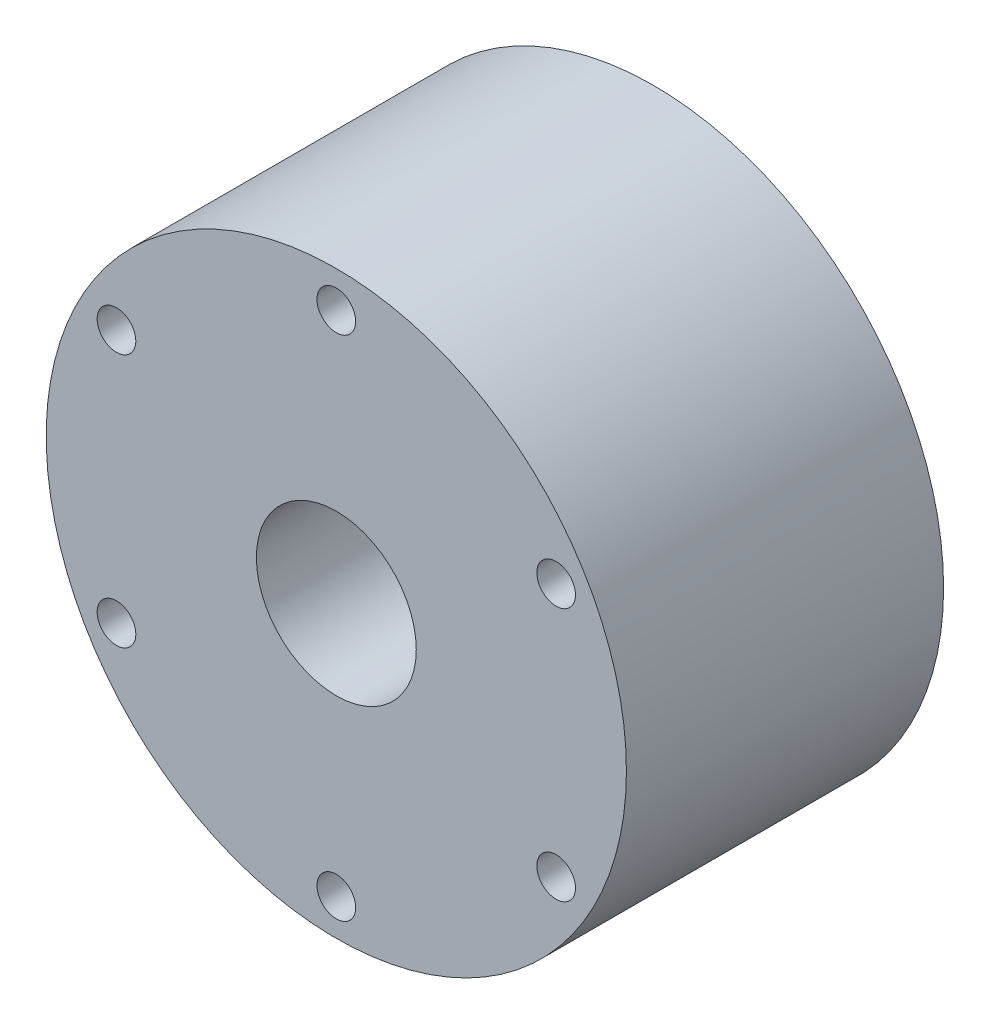
ISO-10303-21;
HEADER;
FILE_DESCRIPTION(('STEP AP214'),'2;1');
FILE_NAME('part.step','',(''),(''),'','','');
FILE_SCHEMA(('AUTOMOTIVE_DESIGN { 1 0 10303 214 1 1 1 1 }'));
ENDSEC;
DATA;
#1=APPLICATION_CONTEXT('core data for automotive mechanical design processes');
#2=APPLICATION_PROTOCOL_DEFINITION('international standard','automotive_design',2000,#1);
#3=PRODUCT_CONTEXT('',#1,'mechanical');
#4=PRODUCT('Part','Part','',(#3));
#5=PRODUCT_RELATED_PRODUCT_CATEGORY('part','',(#4));
#6=PRODUCT_DEFINITION_FORMATION('','',#4);
#7=PRODUCT_DEFINITION_CONTEXT('part definition',#1,'design');
#8=PRODUCT_DEFINITION('design','',#6,#7);
#9=PRODUCT_DEFINITION_SHAPE('','',#8);
#10=(LENGTH_UNIT() NAMED_UNIT(*) SI_UNIT(.MILLI.,.METRE.));
#11=(NAMED_UNIT(*) PLANE_ANGLE_UNIT() SI_UNIT($,.RADIAN.));
#12=(NAMED_UNIT(*) SI_UNIT($,.STERADIAN.) SOLID_ANGLE_UNIT());
#13=UNCERTAINTY_MEASURE_WITH_UNIT(LENGTH_MEASURE(1.E-05),#10,'distance_accuracy_value','');
#14=(GEOMETRIC_REPRESENTATION_CONTEXT(3) GLOBAL_UNCERTAINTY_ASSIGNED_CONTEXT((#13)) GLOBAL_UNIT_ASSIGNED_CONTEXT((#10,
#11,#12)) REPRESENTATION_CONTEXT('',''));
#15=CARTESIAN_POINT('',(0.,0.,0.));
#16=DIRECTION('',(0.,0.,1.));
#17=DIRECTION('',(1.,0.,0.));
#18=AXIS2_PLACEMENT_3D('',#15,#16,#17);
#19=CARTESIAN_POINT('',(0.,0.,20.828));
#20=DIRECTION('',(0.,0.,-1.));
#21=DIRECTION('',(-1.,0.,0.));
#22=AXIS2_PLACEMENT_3D('',#19,#20,#21);
#23=CYLINDRICAL_SURFACE('',#22,10.5);
#24=CARTESIAN_POINT('',(0.,0.,20.828));
#25=DIRECTION('',(0.,0.,1.));
#26=DIRECTION('',(1.,0.,0.));
#27=AXIS2_PLACEMENT_3D('',#24,#25,#26);
#28=CIRCLE('',#27,10.5);
#29=CARTESIAN_POINT('',(10.5,0.,20.828));
#30=VERTEX_POINT('',#29);
#31=EDGE_CURVE('E45',#30,#30,#28,.T.);
#32=ORIENTED_EDGE('',*,*,#31,.T.);
#33=EDGE_LOOP('',(#32));
#34=FACE_BOUND('',#33,.T.);
#35=CARTESIAN_POINT('',(0.,0.,-18.917999972));
#36=DIRECTION('',(0.,0.,-1.));
#37=DIRECTION('',(-1.,0.,0.));
#38=AXIS2_PLACEMENT_3D('',#35,#36,#37);
#39=CIRCLE('',#38,10.5);
#40=CARTESIAN_POINT('',(-10.5,0.,-18.917999972));
#41=VERTEX_POINT('',#40);
#42=EDGE_CURVE('E36',#41,#41,#39,.T.);
#43=ORIENTED_EDGE('',*,*,#42,.T.);
#44=EDGE_LOOP('',(#43));
#45=FACE_BOUND('',#44,.T.);
#46=ADVANCED_FACE('F32',(#34,#45),#23,.F.);
#47=CARTESIAN_POINT('',(0.,0.,20.828));
#48=DIRECTION('',(0.,0.,1.));
#49=DIRECTION('',(1.,0.,0.));
#50=AXIS2_PLACEMENT_3D('',#47,#48,#49);
#51=PLANE('',#50);
#52=CARTESIAN_POINT('',(0.,33.3375,20.828));
#53=DIRECTION('',(0.,0.,1.));
#54=DIRECTION('',(1.,0.,0.));
#55=AXIS2_PLACEMENT_3D('',#52,#53,#54);
#56=CIRCLE('',#55,2.54);
#57=CARTESIAN_POINT('',(2.54,33.3375,20.828));
#58=VERTEX_POINT('',#57);
#59=EDGE_CURVE('E81',#58,#58,#56,.T.);
#60=ORIENTED_EDGE('',*,*,#59,.F.);
#61=EDGE_LOOP('',(#60));
#62=FACE_BOUND('',#61,.T.);
#63=CARTESIAN_POINT('',(-28.8711218986635,16.6687500000003,20.828));
#64=DIRECTION('',(0.,0.,1.));
#65=DIRECTION('',(1.,0.,0.));
#66=AXIS2_PLACEMENT_3D('',#63,#64,#65);
#67=CIRCLE('',#66,2.54);
#68=CARTESIAN_POINT('',(-26.3311218986635,16.6687500000003,20.828));
#69=VERTEX_POINT('',#68);
#70=EDGE_CURVE('E82',#69,#69,#67,.T.);
#71=ORIENTED_EDGE('',*,*,#70,.F.);
#72=EDGE_LOOP('',(#71));
#73=FACE_BOUND('',#72,.T.);
#74=CARTESIAN_POINT('',(-28.8711218986637,-16.66875,20.828));
#75=DIRECTION('',(0.,0.,1.));
#76=DIRECTION('',(1.,0.,0.));
#77=AXIS2_PLACEMENT_3D('',#74,#75,#76);
#78=CIRCLE('',#77,2.54);
#79=CARTESIAN_POINT('',(-26.3311218986637,-16.66875,20.828));
#80=VERTEX_POINT('',#79);
#81=EDGE_CURVE('E56',#80,#80,#78,.T.);
#82=ORIENTED_EDGE('',*,*,#81,.F.);
#83=EDGE_LOOP('',(#82));
#84=FACE_BOUND('',#83,.T.);
#85=CARTESIAN_POINT('',(-2.32794518267366E-13,-33.3375,20.828));
#86=DIRECTION('',(0.,0.,1.));
#87=DIRECTION('',(1.,0.,0.));
#88=AXIS2_PLACEMENT_3D('',#85,#86,#87);
#89=CIRCLE('',#88,2.54);
#90=CARTESIAN_POINT('',(2.53999999999977,-33.3375,20.828));
#91=VERTEX_POINT('',#90);
#92=EDGE_CURVE('E63',#91,#91,#89,.T.);
#93=ORIENTED_EDGE('',*,*,#92,.F.);
#94=EDGE_LOOP('',(#93));
#95=FACE_BOUND('',#94,.T.);
#96=CARTESIAN_POINT('',(28.8711218986636,-16.6687500000001,20.828));
#97=DIRECTION('',(0.,0.,1.));
#98=DIRECTION('',(1.,0.,0.));
#99=AXIS2_PLACEMENT_3D('',#96,#97,#98);
#100=CIRCLE('',#99,2.54);
#101=CARTESIAN_POINT('',(31.4111218986637,-16.6687500000001,20.828));
#102=VERTEX_POINT('',#101);
#103=EDGE_CURVE('E69',#102,#102,#100,.T.);
#104=ORIENTED_EDGE('',*,*,#103,.F.);
#105=EDGE_LOOP('',(#104));
#106=FACE_BOUND('',#105,.T.);
#107=CARTESIAN_POINT('',(28.8711218986638,16.6687499999999,20.828));
#108=DIRECTION('',(0.,0.,1.));
#109=DIRECTION('',(1.,0.,0.));
#110=AXIS2_PLACEMENT_3D('',#107,#108,#109);
#111=CIRCLE('',#110,2.54);
#112=CARTESIAN_POINT('',(31.4111218986638,16.6687499999999,20.828));
#113=VERTEX_POINT('',#112);
#114=EDGE_CURVE('E75',#113,#113,#111,.T.);
#115=ORIENTED_EDGE('',*,*,#114,.F.);
#116=EDGE_LOOP('',(#115));
#117=FACE_BOUND('',#116,.T.);
#118=CARTESIAN_POINT('',(0.,0.,20.828));
#119=DIRECTION('',(0.,0.,1.));
#120=DIRECTION('',(1.,0.,0.));
#121=AXIS2_PLACEMENT_3D('',#118,#119,#120);
#122=CIRCLE('',#121,38.1);
#123=CARTESIAN_POINT('',(38.1,0.,20.828));
#124=VERTEX_POINT('',#123);
#125=EDGE_CURVE('E10',#124,#124,#122,.T.);
#126=ORIENTED_EDGE('',*,*,#125,.T.);
#127=EDGE_LOOP('',(#126));
#128=FACE_BOUND('',#127,.T.);
#129=ORIENTED_EDGE('',*,*,#31,.F.);
#130=EDGE_LOOP('',(#129));
#131=FACE_BOUND('',#130,.T.);
#132=ADVANCED_FACE('F113',(#62,#73,#84,#95,#106,#117,#128,#131),#51,.T.);
#133=CARTESIAN_POINT('',(0.,0.,-20.828));
#134=DIRECTION('',(0.,0.,1.));
#135=DIRECTION('',(1.,0.,0.));
#136=AXIS2_PLACEMENT_3D('',#133,#134,#135);
#137=PLANE('',#136);
#138=CARTESIAN_POINT('',(0.,33.3375,-20.828));
#139=DIRECTION('',(0.,0.,1.));
#140=DIRECTION('',(1.,0.,0.));
#141=AXIS2_PLACEMENT_3D('',#138,#139,#140);
#142=CIRCLE('',#141,2.54);
#143=CARTESIAN_POINT('',(2.54,33.3375,-20.828));
#144=VERTEX_POINT('',#143);
#145=EDGE_CURVE('E53',#144,#144,#142,.T.);
#146=ORIENTED_EDGE('',*,*,#145,.T.);
#147=EDGE_LOOP('',(#146));
#148=FACE_BOUND('',#147,.T.);
#149=CARTESIAN_POINT('',(-28.8711218986635,16.6687500000003,-20.828));
#150=DIRECTION('',(0.,0.,1.));
#151=DIRECTION('',(1.,0.,0.));
#152=AXIS2_PLACEMENT_3D('',#149,#150,#151);
#153=CIRCLE('',#152,2.54);
#154=CARTESIAN_POINT('',(-26.3311218986635,16.6687500000003,-20.828));
#155=VERTEX_POINT('',#154);
#156=EDGE_CURVE('E60',#155,#155,#153,.T.);
#157=ORIENTED_EDGE('',*,*,#156,.T.);
#158=EDGE_LOOP('',(#157));
#159=FACE_BOUND('',#158,.T.);
#160=CARTESIAN_POINT('',(-28.8711218986637,-16.66875,-20.828));
#161=DIRECTION('',(0.,0.,1.));
#162=DIRECTION('',(1.,0.,0.));
#163=AXIS2_PLACEMENT_3D('',#160,#161,#162);
#164=CIRCLE('',#163,2.54);
#165=CARTESIAN_POINT('',(-26.3311218986637,-16.66875,-20.828));
#166=VERTEX_POINT('',#165);
#167=EDGE_CURVE('E59',#166,#166,#164,.T.);
#168=ORIENTED_EDGE('',*,*,#167,.T.);
#169=EDGE_LOOP('',(#168));
#170=FACE_BOUND('',#169,.T.);
#171=CARTESIAN_POINT('',(-2.32794518267366E-13,-33.3375,-20.828));
#172=DIRECTION('',(0.,0.,1.));
#173=DIRECTION('',(1.,0.,0.));
#174=AXIS2_PLACEMENT_3D('',#171,#172,#173);
#175=CIRCLE('',#174,2.54);
#176=CARTESIAN_POINT('',(2.53999999999977,-33.3375,-20.828));
#177=VERTEX_POINT('',#176);
#178=EDGE_CURVE('E66',#177,#177,#175,.T.);
#179=ORIENTED_EDGE('',*,*,#178,.T.);
#180=EDGE_LOOP('',(#179));
#181=FACE_BOUND('',#180,.T.);
#182=CARTESIAN_POINT('',(28.8711218986636,-16.6687500000001,-20.828));
#183=DIRECTION('',(0.,0.,1.));
#184=DIRECTION('',(1.,0.,0.));
#185=AXIS2_PLACEMENT_3D('',#182,#183,#184);
#186=CIRCLE('',#185,2.54);
#187=CARTESIAN_POINT('',(31.4111218986637,-16.6687500000001,-20.828));
#188=VERTEX_POINT('',#187);
#189=EDGE_CURVE('E72',#188,#188,#186,.T.);
#190=ORIENTED_EDGE('',*,*,#189,.T.);
#191=EDGE_LOOP('',(#190));
#192=FACE_BOUND('',#191,.T.);
#193=CARTESIAN_POINT('',(28.8711218986638,16.6687499999999,-20.828));
#194=DIRECTION('',(0.,0.,1.));
#195=DIRECTION('',(1.,0.,0.));
#196=AXIS2_PLACEMENT_3D('',#193,#194,#195);
#197=CIRCLE('',#196,2.54);
#198=CARTESIAN_POINT('',(31.4111218986638,16.6687499999999,-20.828));
#199=VERTEX_POINT('',#198);
#200=EDGE_CURVE('E78',#199,#199,#197,.T.);
#201=ORIENTED_EDGE('',*,*,#200,.T.);
#202=EDGE_LOOP('',(#201));
#203=FACE_BOUND('',#202,.T.);
#204=CARTESIAN_POINT('',(0.,0.,-20.828));
#205=DIRECTION('',(0.,0.,-1.));
#206=DIRECTION('',(-1.,0.,0.));
#207=AXIS2_PLACEMENT_3D('',#204,#205,#206);
#208=CIRCLE('',#207,17.75000006);
#209=CARTESIAN_POINT('',(-17.75000006,0.,-20.828));
#210=VERTEX_POINT('',#209);
#211=EDGE_CURVE('E50',#210,#210,#208,.T.);
#212=ORIENTED_EDGE('',*,*,#211,.F.);
#213=EDGE_LOOP('',(#212));
#214=FACE_BOUND('',#213,.T.);
#215=CARTESIAN_POINT('',(0.,0.,-20.828));
#216=DIRECTION('',(0.,0.,1.));
#217=DIRECTION('',(1.,0.,0.));
#218=AXIS2_PLACEMENT_3D('',#215,#216,#217);
#219=CIRCLE('',#218,38.1);
#220=CARTESIAN_POINT('',(38.1,0.,-20.828));
#221=VERTEX_POINT('',#220);
#222=EDGE_CURVE('E40',#221,#221,#219,.T.);
#223=ORIENTED_EDGE('',*,*,#222,.F.);
#224=EDGE_LOOP('',(#223));
#225=FACE_BOUND('',#224,.T.);
#226=ADVANCED_FACE('F119',(#148,#159,#170,#181,#192,#203,#214,#225),#137,.F.);
#227=CARTESIAN_POINT('',(0.,0.,20.828));
#228=DIRECTION('',(0.,0.,-1.));
#229=DIRECTION('',(-1.,0.,0.));
#230=AXIS2_PLACEMENT_3D('',#227,#228,#229);
#231=CYLINDRICAL_SURFACE('',#230,38.1);
#232=ORIENTED_EDGE('',*,*,#125,.F.);
#233=EDGE_LOOP('',(#232));
#234=FACE_BOUND('',#233,.T.);
#235=ORIENTED_EDGE('',*,*,#222,.T.);
#236=EDGE_LOOP('',(#235));
#237=FACE_BOUND('',#236,.T.);
#238=ADVANCED_FACE('F34',(#234,#237),#231,.T.);
#239=CARTESIAN_POINT('',(0.,0.,-19.317999972));
#240=DIRECTION('',(0.,0.,-1.));
#241=DIRECTION('',(-1.,0.,0.));
#242=AXIS2_PLACEMENT_3D('',#239,#240,#241);
#243=CYLINDRICAL_SURFACE('',#242,17.75000006);
#244=CARTESIAN_POINT('',(0.,0.,-19.317999972));
#245=DIRECTION('',(0.,0.,-1.));
#246=DIRECTION('',(-1.,0.,0.));
#247=AXIS2_PLACEMENT_3D('',#244,#245,#246);
#248=CIRCLE('',#247,17.75000006);
#249=CARTESIAN_POINT('',(-17.75000006,0.,-19.317999972));
#250=VERTEX_POINT('',#249);
#251=EDGE_CURVE('E49',#250,#250,#248,.T.);
#252=ORIENTED_EDGE('',*,*,#251,.F.);
#253=EDGE_LOOP('',(#252));
#254=FACE_BOUND('',#253,.T.);
#255=ORIENTED_EDGE('',*,*,#211,.T.);
#256=EDGE_LOOP('',(#255));
#257=FACE_BOUND('',#256,.T.);
#258=ADVANCED_FACE('F123',(#254,#257),#243,.F.);
#259=CARTESIAN_POINT('',(0.,0.,-19.317999972));
#260=DIRECTION('',(0.,0.,-1.));
#261=DIRECTION('',(-1.,0.,0.));
#262=AXIS2_PLACEMENT_3D('',#259,#260,#261);
#263=PLANE('',#262);
#264=CARTESIAN_POINT('',(0.,0.,-19.317999972));
#265=DIRECTION('',(0.,0.,-1.));
#266=DIRECTION('',(-1.,0.,0.));
#267=AXIS2_PLACEMENT_3D('',#264,#265,#266);
#268=CIRCLE('',#267,14.09889992);
#269=CARTESIAN_POINT('',(-14.09889992,0.,-19.317999972));
#270=VERTEX_POINT('',#269);
#271=EDGE_CURVE('E91',#270,#270,#268,.T.);
#272=ORIENTED_EDGE('',*,*,#271,.F.);
#273=EDGE_LOOP('',(#272));
#274=FACE_BOUND('',#273,.T.);
#275=ORIENTED_EDGE('',*,*,#251,.T.);
#276=EDGE_LOOP('',(#275));
#277=FACE_BOUND('',#276,.T.);
#278=ADVANCED_FACE('F149',(#274,#277),#263,.T.);
#279=CARTESIAN_POINT('',(28.8711218986638,16.6687499999999,-20.828));
#280=DIRECTION('',(0.,0.,1.));
#281=DIRECTION('',(1.,0.,0.));
#282=AXIS2_PLACEMENT_3D('',#279,#280,#281);
#283=CYLINDRICAL_SURFACE('',#282,2.54);
#284=ORIENTED_EDGE('',*,*,#200,.F.);
#285=EDGE_LOOP('',(#284));
#286=FACE_BOUND('',#285,.T.);
#287=ORIENTED_EDGE('',*,*,#114,.T.);
#288=EDGE_LOOP('',(#287));
#289=FACE_BOUND('',#288,.T.);
#290=ADVANCED_FACE('F154',(#286,#289),#283,.F.);
#291=CARTESIAN_POINT('',(28.8711218986636,-16.6687500000001,-20.828));
#292=DIRECTION('',(0.,0.,1.));
#293=DIRECTION('',(1.,0.,0.));
#294=AXIS2_PLACEMENT_3D('',#291,#292,#293);
#295=CYLINDRICAL_SURFACE('',#294,2.54);
#296=ORIENTED_EDGE('',*,*,#189,.F.);
#297=EDGE_LOOP('',(#296));
#298=FACE_BOUND('',#297,.T.);
#299=ORIENTED_EDGE('',*,*,#103,.T.);
#300=EDGE_LOOP('',(#299));
#301=FACE_BOUND('',#300,.T.);
#302=ADVANCED_FACE('F161',(#298,#301),#295,.F.);
#303=CARTESIAN_POINT('',(-2.32794518267366E-13,-33.3375,-20.828));
#304=DIRECTION('',(0.,0.,1.));
#305=DIRECTION('',(1.,0.,0.));
#306=AXIS2_PLACEMENT_3D('',#303,#304,#305);
#307=CYLINDRICAL_SURFACE('',#306,2.54);
#308=ORIENTED_EDGE('',*,*,#178,.F.);
#309=EDGE_LOOP('',(#308));
#310=FACE_BOUND('',#309,.T.);
#311=ORIENTED_EDGE('',*,*,#92,.T.);
#312=EDGE_LOOP('',(#311));
#313=FACE_BOUND('',#312,.T.);
#314=ADVANCED_FACE('F170',(#310,#313),#307,.F.);
#315=CARTESIAN_POINT('',(-28.8711218986637,-16.66875,-20.828));
#316=DIRECTION('',(0.,0.,1.));
#317=DIRECTION('',(1.,0.,0.));
#318=AXIS2_PLACEMENT_3D('',#315,#316,#317);
#319=CYLINDRICAL_SURFACE('',#318,2.54);
#320=ORIENTED_EDGE('',*,*,#167,.F.);
#321=EDGE_LOOP('',(#320));
#322=FACE_BOUND('',#321,.T.);
#323=ORIENTED_EDGE('',*,*,#81,.T.);
#324=EDGE_LOOP('',(#323));
#325=FACE_BOUND('',#324,.T.);
#326=ADVANCED_FACE('F166',(#322,#325),#319,.F.);
#327=CARTESIAN_POINT('',(-28.8711218986635,16.6687500000003,-20.828));
#328=DIRECTION('',(0.,0.,1.));
#329=DIRECTION('',(1.,0.,0.));
#330=AXIS2_PLACEMENT_3D('',#327,#328,#329);
#331=CYLINDRICAL_SURFACE('',#330,2.54);
#332=ORIENTED_EDGE('',*,*,#156,.F.);
#333=EDGE_LOOP('',(#332));
#334=FACE_BOUND('',#333,.T.);
#335=ORIENTED_EDGE('',*,*,#70,.T.);
#336=EDGE_LOOP('',(#335));
#337=FACE_BOUND('',#336,.T.);
#338=ADVANCED_FACE('F169',(#334,#337),#331,.F.);
#339=CARTESIAN_POINT('',(0.,33.3375,-20.828));
#340=DIRECTION('',(0.,0.,1.));
#341=DIRECTION('',(1.,0.,0.));
#342=AXIS2_PLACEMENT_3D('',#339,#340,#341);
#343=CYLINDRICAL_SURFACE('',#342,2.54);
#344=ORIENTED_EDGE('',*,*,#145,.F.);
#345=EDGE_LOOP('',(#344));
#346=FACE_BOUND('',#345,.T.);
#347=ORIENTED_EDGE('',*,*,#59,.T.);
#348=EDGE_LOOP('',(#347));
#349=FACE_BOUND('',#348,.T.);
#350=ADVANCED_FACE('F109',(#346,#349),#343,.F.);
#351=CARTESIAN_POINT('',(0.,0.,-18.917999972));
#352=DIRECTION('',(0.,0.,-1.));
#353=DIRECTION('',(-1.,0.,0.));
#354=AXIS2_PLACEMENT_3D('',#351,#352,#353);
#355=CYLINDRICAL_SURFACE('',#354,14.09889992);
#356=CARTESIAN_POINT('',(0.,0.,-18.917999972));
#357=DIRECTION('',(0.,0.,-1.));
#358=DIRECTION('',(-1.,0.,0.));
#359=AXIS2_PLACEMENT_3D('',#356,#357,#358);
#360=CIRCLE('',#359,14.09889992);
#361=CARTESIAN_POINT('',(-14.09889992,0.,-18.917999972));
#362=VERTEX_POINT('',#361);
#363=EDGE_CURVE('E94',#362,#362,#360,.T.);
#364=ORIENTED_EDGE('',*,*,#363,.F.);
#365=EDGE_LOOP('',(#364));
#366=FACE_BOUND('',#365,.T.);
#367=ORIENTED_EDGE('',*,*,#271,.T.);
#368=EDGE_LOOP('',(#367));
#369=FACE_BOUND('',#368,.T.);
#370=ADVANCED_FACE('F104',(#366,#369),#355,.F.);
#371=CARTESIAN_POINT('',(0.,0.,-18.917999972));
#372=DIRECTION('',(0.,0.,-1.));
#373=DIRECTION('',(-1.,0.,0.));
#374=AXIS2_PLACEMENT_3D('',#371,#372,#373);
#375=PLANE('',#374);
#376=ORIENTED_EDGE('',*,*,#42,.F.);
#377=EDGE_LOOP('',(#376));
#378=FACE_BOUND('',#377,.T.);
#379=ORIENTED_EDGE('',*,*,#363,.T.);
#380=EDGE_LOOP('',(#379));
#381=FACE_BOUND('',#380,.T.);
#382=ADVANCED_FACE('F102',(#378,#381),#375,.T.);
#383=CLOSED_SHELL('',(#46,#132,#226,#238,#258,#278,#290,#302,#314,#326,#338,#350,#370,#382));
#384=MANIFOLD_SOLID_BREP('B2',#383);
#385=ADVANCED_BREP_SHAPE_REPRESENTATION('',(#18,#384),#14);
#386=SHAPE_DEFINITION_REPRESENTATION(#9,#385);
ENDSEC;
END-ISO-10303-21;
